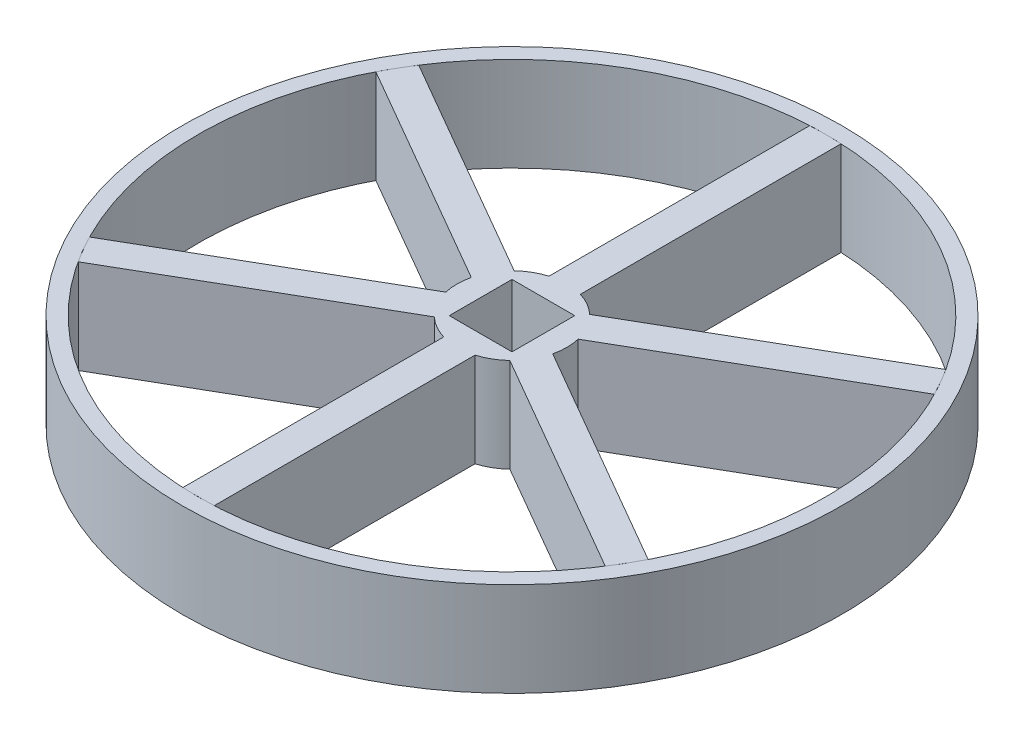
ISO-10303-21;
HEADER;
FILE_DESCRIPTION(('STEP AP214'),'2;1');
FILE_NAME('part.step','',(''),(''),'','','');
FILE_SCHEMA(('AUTOMOTIVE_DESIGN { 1 0 10303 214 1 1 1 1 }'));
ENDSEC;
DATA;
#1=APPLICATION_CONTEXT('core data for automotive mechanical design processes');
#2=APPLICATION_PROTOCOL_DEFINITION('international standard','automotive_design',2000,#1);
#3=PRODUCT_CONTEXT('',#1,'mechanical');
#4=PRODUCT('Part','Part','',(#3));
#5=PRODUCT_RELATED_PRODUCT_CATEGORY('part','',(#4));
#6=PRODUCT_DEFINITION_FORMATION('','',#4);
#7=PRODUCT_DEFINITION_CONTEXT('part definition',#1,'design');
#8=PRODUCT_DEFINITION('design','',#6,#7);
#9=PRODUCT_DEFINITION_SHAPE('','',#8);
#10=(LENGTH_UNIT() NAMED_UNIT(*) SI_UNIT(.MILLI.,.METRE.));
#11=(NAMED_UNIT(*) PLANE_ANGLE_UNIT() SI_UNIT($,.RADIAN.));
#12=(NAMED_UNIT(*) SI_UNIT($,.STERADIAN.) SOLID_ANGLE_UNIT());
#13=UNCERTAINTY_MEASURE_WITH_UNIT(LENGTH_MEASURE(1.E-05),#10,'distance_accuracy_value','');
#14=(GEOMETRIC_REPRESENTATION_CONTEXT(3) GLOBAL_UNCERTAINTY_ASSIGNED_CONTEXT((#13)) GLOBAL_UNIT_ASSIGNED_CONTEXT((#10,
#11,#12)) REPRESENTATION_CONTEXT('',''));
#15=CARTESIAN_POINT('',(0.,0.,0.));
#16=DIRECTION('',(0.,0.,1.));
#17=DIRECTION('',(1.,0.,0.));
#18=AXIS2_PLACEMENT_3D('',#15,#16,#17);
#19=CARTESIAN_POINT('',(0.,6.,0.));
#20=DIRECTION('',(0.,-1.,0.));
#21=DIRECTION('',(0.,0.,-1.));
#22=AXIS2_PLACEMENT_3D('',#19,#20,#21);
#23=CYLINDRICAL_SURFACE('',#22,3.5);
#24=CARTESIAN_POINT('',(0.,0.,0.));
#25=DIRECTION('',(0.,1.,0.));
#26=DIRECTION('',(0.,0.,1.));
#27=AXIS2_PLACEMENT_3D('',#24,#25,#26);
#28=CIRCLE('',#27,3.5);
#29=CARTESIAN_POINT('',(-2.40473750965557,0.,2.54307638690928));
#30=VERTEX_POINT('',#29);
#31=CARTESIAN_POINT('',(-1.,0.,3.35410196624968));
#32=VERTEX_POINT('',#31);
#33=EDGE_CURVE('E549',#30,#32,#28,.T.);
#34=ORIENTED_EDGE('',*,*,#33,.T.);
#35=DIRECTION('',(0.,-1.,0.));
#36=VECTOR('',#35,1.);
#37=CARTESIAN_POINT('',(-1.,6.,3.35410196624968));
#38=LINE('',#37,#36);
#39=CARTESIAN_POINT('',(-1.,6.,3.35410196624968));
#40=VERTEX_POINT('',#39);
#41=EDGE_CURVE('E556',#40,#32,#38,.T.);
#42=ORIENTED_EDGE('',*,*,#41,.F.);
#43=CARTESIAN_POINT('',(0.,6.,0.));
#44=DIRECTION('',(0.,1.,0.));
#45=DIRECTION('',(0.,0.,1.));
#46=AXIS2_PLACEMENT_3D('',#43,#44,#45);
#47=CIRCLE('',#46,3.5);
#48=CARTESIAN_POINT('',(-2.40473750965557,6.,2.54307638690928));
#49=VERTEX_POINT('',#48);
#50=EDGE_CURVE('E550',#49,#40,#47,.T.);
#51=ORIENTED_EDGE('',*,*,#50,.F.);
#52=DIRECTION('',(0.,-1.,0.));
#53=VECTOR('',#52,1.);
#54=CARTESIAN_POINT('',(-2.40473750965557,6.,2.54307638690928));
#55=LINE('',#54,#53);
#56=EDGE_CURVE('E558',#49,#30,#55,.T.);
#57=ORIENTED_EDGE('',*,*,#56,.T.);
#58=EDGE_LOOP('',(#34,#42,#51,#57));
#59=FACE_BOUND('',#58,.T.);
#60=ADVANCED_FACE('F331',(#59),#23,.T.);
#61=CARTESIAN_POINT('',(-0.999999999999976,0.,-3.35410196624969));
#62=VERTEX_POINT('',#61);
#63=CARTESIAN_POINT('',(-2.40473750965555,0.,-2.54307638690929));
#64=VERTEX_POINT('',#63);
#65=EDGE_CURVE('E830',#62,#64,#28,.T.);
#66=ORIENTED_EDGE('',*,*,#65,.T.);
#67=DIRECTION('',(0.,-1.,0.));
#68=VECTOR('',#67,1.);
#69=CARTESIAN_POINT('',(-2.40473750965555,6.,-2.54307638690929));
#70=LINE('',#69,#68);
#71=CARTESIAN_POINT('',(-2.40473750965555,6.,-2.54307638690929));
#72=VERTEX_POINT('',#71);
#73=EDGE_CURVE('E564',#72,#64,#70,.T.);
#74=ORIENTED_EDGE('',*,*,#73,.F.);
#75=CARTESIAN_POINT('',(-0.999999999999976,6.,-3.35410196624969));
#76=VERTEX_POINT('',#75);
#77=EDGE_CURVE('E853',#76,#72,#47,.T.);
#78=ORIENTED_EDGE('',*,*,#77,.F.);
#79=DIRECTION('',(0.,-1.,0.));
#80=VECTOR('',#79,1.);
#81=CARTESIAN_POINT('',(-0.999999999999976,6.,-3.35410196624969));
#82=LINE('',#81,#80);
#83=EDGE_CURVE('E566',#76,#62,#82,.T.);
#84=ORIENTED_EDGE('',*,*,#83,.T.);
#85=EDGE_LOOP('',(#66,#74,#78,#84));
#86=FACE_BOUND('',#85,.T.);
#87=ADVANCED_FACE('F789',(#86),#23,.T.);
#88=CARTESIAN_POINT('',(2.40473750965559,0.,-2.54307638690926));
#89=VERTEX_POINT('',#88);
#90=CARTESIAN_POINT('',(1.00000000000002,0.,-3.35410196624968));
#91=VERTEX_POINT('',#90);
#92=EDGE_CURVE('E834',#89,#91,#28,.T.);
#93=ORIENTED_EDGE('',*,*,#92,.T.);
#94=DIRECTION('',(0.,-1.,0.));
#95=VECTOR('',#94,1.);
#96=CARTESIAN_POINT('',(1.00000000000002,6.,-3.35410196624968));
#97=LINE('',#96,#95);
#98=CARTESIAN_POINT('',(1.00000000000002,6.,-3.35410196624968));
#99=VERTEX_POINT('',#98);
#100=EDGE_CURVE('E568',#99,#91,#97,.T.);
#101=ORIENTED_EDGE('',*,*,#100,.F.);
#102=CARTESIAN_POINT('',(2.40473750965559,6.,-2.54307638690926));
#103=VERTEX_POINT('',#102);
#104=EDGE_CURVE('E852',#103,#99,#47,.T.);
#105=ORIENTED_EDGE('',*,*,#104,.F.);
#106=DIRECTION('',(0.,-1.,0.));
#107=VECTOR('',#106,1.);
#108=CARTESIAN_POINT('',(2.40473750965559,6.,-2.54307638690926));
#109=LINE('',#108,#107);
#110=EDGE_CURVE('E570',#103,#89,#109,.T.);
#111=ORIENTED_EDGE('',*,*,#110,.T.);
#112=EDGE_LOOP('',(#93,#101,#105,#111));
#113=FACE_BOUND('',#112,.T.);
#114=ADVANCED_FACE('F802',(#113),#23,.T.);
#115=CARTESIAN_POINT('',(3.40473750965555,0.,0.811025579340444));
#116=VERTEX_POINT('',#115);
#117=CARTESIAN_POINT('',(3.40473750965557,0.,-0.811025579340372));
#118=VERTEX_POINT('',#117);
#119=EDGE_CURVE('E554',#116,#118,#28,.T.);
#120=ORIENTED_EDGE('',*,*,#119,.T.);
#121=DIRECTION('',(0.,-1.,0.));
#122=VECTOR('',#121,1.);
#123=CARTESIAN_POINT('',(3.40473750965557,6.,-0.811025579340372));
#124=LINE('',#123,#122);
#125=CARTESIAN_POINT('',(3.40473750965557,6.,-0.811025579340372));
#126=VERTEX_POINT('',#125);
#127=EDGE_CURVE('E572',#126,#118,#124,.T.);
#128=ORIENTED_EDGE('',*,*,#127,.F.);
#129=CARTESIAN_POINT('',(3.40473750965555,6.,0.811025579340444));
#130=VERTEX_POINT('',#129);
#131=EDGE_CURVE('E548',#130,#126,#47,.T.);
#132=ORIENTED_EDGE('',*,*,#131,.F.);
#133=DIRECTION('',(0.,-1.,0.));
#134=VECTOR('',#133,1.);
#135=CARTESIAN_POINT('',(3.40473750965555,6.,0.811025579340444));
#136=LINE('',#135,#134);
#137=EDGE_CURVE('E574',#130,#116,#136,.T.);
#138=ORIENTED_EDGE('',*,*,#137,.T.);
#139=EDGE_LOOP('',(#120,#128,#132,#138));
#140=FACE_BOUND('',#139,.T.);
#141=ADVANCED_FACE('F797',(#140),#23,.T.);
#142=CARTESIAN_POINT('',(1.,0.,3.35410196624968));
#143=VERTEX_POINT('',#142);
#144=CARTESIAN_POINT('',(2.40473750965553,0.,2.54307638690931));
#145=VERTEX_POINT('',#144);
#146=EDGE_CURVE('E551',#143,#145,#28,.T.);
#147=ORIENTED_EDGE('',*,*,#146,.T.);
#148=DIRECTION('',(0.,-1.,0.));
#149=VECTOR('',#148,1.);
#150=CARTESIAN_POINT('',(2.40473750965553,6.,2.54307638690931));
#151=LINE('',#150,#149);
#152=CARTESIAN_POINT('',(2.40473750965553,6.,2.54307638690931));
#153=VERTEX_POINT('',#152);
#154=EDGE_CURVE('E576',#153,#145,#151,.T.);
#155=ORIENTED_EDGE('',*,*,#154,.F.);
#156=CARTESIAN_POINT('',(1.,6.,3.35410196624968));
#157=VERTEX_POINT('',#156);
#158=EDGE_CURVE('E545',#157,#153,#47,.T.);
#159=ORIENTED_EDGE('',*,*,#158,.F.);
#160=DIRECTION('',(0.,-1.,0.));
#161=VECTOR('',#160,1.);
#162=CARTESIAN_POINT('',(1.,6.,3.35410196624968));
#163=LINE('',#162,#161);
#164=EDGE_CURVE('E578',#157,#143,#163,.T.);
#165=ORIENTED_EDGE('',*,*,#164,.T.);
#166=EDGE_LOOP('',(#147,#155,#159,#165));
#167=FACE_BOUND('',#166,.T.);
#168=ADVANCED_FACE('F791',(#167),#23,.T.);
#169=CARTESIAN_POINT('',(0.,6.,0.));
#170=DIRECTION('',(0.,1.,0.));
#171=DIRECTION('',(0.,0.,1.));
#172=AXIS2_PLACEMENT_3D('',#169,#170,#171);
#173=PLANE('',#172);
#174=DIRECTION('',(0.,0.,1.));
#175=VECTOR('',#174,1.);
#176=CARTESIAN_POINT('',(-2.,6.,-2.));
#177=LINE('',#176,#175);
#178=CARTESIAN_POINT('',(-2.,6.,-2.));
#179=VERTEX_POINT('',#178);
#180=CARTESIAN_POINT('',(-2.,6.,2.));
#181=VERTEX_POINT('',#180);
#182=EDGE_CURVE('E346',#179,#181,#177,.T.);
#183=ORIENTED_EDGE('',*,*,#182,.F.);
#184=DIRECTION('',(-1.,0.,0.));
#185=VECTOR('',#184,1.);
#186=CARTESIAN_POINT('',(-2.,6.,-2.));
#187=LINE('',#186,#185);
#188=CARTESIAN_POINT('',(2.,6.,-2.));
#189=VERTEX_POINT('',#188);
#190=EDGE_CURVE('E535',#189,#179,#187,.T.);
#191=ORIENTED_EDGE('',*,*,#190,.F.);
#192=DIRECTION('',(0.,0.,-1.));
#193=VECTOR('',#192,1.);
#194=CARTESIAN_POINT('',(2.,6.,-2.));
#195=LINE('',#194,#193);
#196=CARTESIAN_POINT('',(2.,6.,2.));
#197=VERTEX_POINT('',#196);
#198=EDGE_CURVE('E519',#197,#189,#195,.T.);
#199=ORIENTED_EDGE('',*,*,#198,.F.);
#200=DIRECTION('',(1.,0.,0.));
#201=VECTOR('',#200,1.);
#202=CARTESIAN_POINT('',(-2.,6.,2.));
#203=LINE('',#202,#201);
#204=EDGE_CURVE('E528',#181,#197,#203,.T.);
#205=ORIENTED_EDGE('',*,*,#204,.F.);
#206=EDGE_LOOP('',(#183,#191,#199,#205));
#207=FACE_BOUND('',#206,.T.);
#208=ORIENTED_EDGE('',*,*,#50,.T.);
#209=DIRECTION('',(0.,0.,1.));
#210=VECTOR('',#209,1.);
#211=CARTESIAN_POINT('',(-1.,6.,3.35410196624968));
#212=LINE('',#211,#210);
#213=CARTESIAN_POINT('',(-0.999999999999998,6.,19.9683336882158));
#214=VERTEX_POINT('',#213);
#215=EDGE_CURVE('E587',#40,#214,#212,.T.);
#216=ORIENTED_EDGE('',*,*,#215,.T.);
#217=CARTESIAN_POINT('',(0.,6.,0.));
#218=DIRECTION('',(0.,1.,0.));
#219=DIRECTION('',(0.,0.,1.));
#220=AXIS2_PLACEMENT_3D('',#217,#218,#219);
#221=CIRCLE('',#220,19.9933576540793);
#222=CARTESIAN_POINT('',(0.999999999999994,6.,19.9683336882158));
#223=VERTEX_POINT('',#222);
#224=EDGE_CURVE('E584',#214,#223,#221,.T.);
#225=ORIENTED_EDGE('',*,*,#224,.T.);
#226=DIRECTION('',(0.,0.,1.));
#227=VECTOR('',#226,1.);
#228=CARTESIAN_POINT('',(1.,6.,3.35410196624968));
#229=LINE('',#228,#227);
#230=EDGE_CURVE('E581',#157,#223,#229,.T.);
#231=ORIENTED_EDGE('',*,*,#230,.F.);
#232=ORIENTED_EDGE('',*,*,#158,.T.);
#233=DIRECTION('',(0.866025403784433,0.,0.50000000000001));
#234=VECTOR('',#233,1.);
#235=CARTESIAN_POINT('',(2.40473750965553,6.,2.54307638690931));
#236=LINE('',#235,#234);
#237=CARTESIAN_POINT('',(16.7930842452393,6.,10.8501922478925));
#238=VERTEX_POINT('',#237);
#239=EDGE_CURVE('E607',#153,#238,#236,.T.);
#240=ORIENTED_EDGE('',*,*,#239,.T.);
#241=CARTESIAN_POINT('',(0.,6.,0.));
#242=DIRECTION('',(0.,1.,0.));
#243=DIRECTION('',(0.,0.,1.));
#244=AXIS2_PLACEMENT_3D('',#241,#242,#243);
#245=CIRCLE('',#244,19.9933576540793);
#246=CARTESIAN_POINT('',(17.7930842452393,6.,9.11814144032364));
#247=VERTEX_POINT('',#246);
#248=EDGE_CURVE('E604',#238,#247,#245,.T.);
#249=ORIENTED_EDGE('',*,*,#248,.T.);
#250=DIRECTION('',(0.866025403784433,0.,0.50000000000001));
#251=VECTOR('',#250,1.);
#252=CARTESIAN_POINT('',(3.40473750965555,6.,0.811025579340444));
#253=LINE('',#252,#251);
#254=EDGE_CURVE('E601',#130,#247,#253,.T.);
#255=ORIENTED_EDGE('',*,*,#254,.F.);
#256=ORIENTED_EDGE('',*,*,#131,.T.);
#257=DIRECTION('',(0.866025403784443,0.,-0.499999999999992));
#258=VECTOR('',#257,1.);
#259=CARTESIAN_POINT('',(3.40473750965557,6.,-0.811025579340372));
#260=LINE('',#259,#258);
#261=CARTESIAN_POINT('',(17.7930842452395,6.,-9.11814144032327));
#262=VERTEX_POINT('',#261);
#263=EDGE_CURVE('E627',#126,#262,#260,.T.);
#264=ORIENTED_EDGE('',*,*,#263,.T.);
#265=CARTESIAN_POINT('',(0.,6.,0.));
#266=DIRECTION('',(0.,1.,0.));
#267=DIRECTION('',(0.,0.,1.));
#268=AXIS2_PLACEMENT_3D('',#265,#266,#267);
#269=CIRCLE('',#268,19.9933576540793);
#270=CARTESIAN_POINT('',(16.7930842452396,6.,-10.8501922478922));
#271=VERTEX_POINT('',#270);
#272=EDGE_CURVE('E624',#262,#271,#269,.T.);
#273=ORIENTED_EDGE('',*,*,#272,.T.);
#274=DIRECTION('',(0.866025403784443,0.,-0.499999999999992));
#275=VECTOR('',#274,1.);
#276=CARTESIAN_POINT('',(2.40473750965559,6.,-2.54307638690926));
#277=LINE('',#276,#275);
#278=EDGE_CURVE('E621',#103,#271,#277,.T.);
#279=ORIENTED_EDGE('',*,*,#278,.F.);
#280=ORIENTED_EDGE('',*,*,#104,.T.);
#281=DIRECTION('',(0.,0.,-1.));
#282=VECTOR('',#281,1.);
#283=CARTESIAN_POINT('',(1.00000000000002,6.,-3.35410196624968));
#284=LINE('',#283,#282);
#285=CARTESIAN_POINT('',(1.00000000000014,6.,-19.9683336882157));
#286=VERTEX_POINT('',#285);
#287=EDGE_CURVE('E647',#99,#286,#284,.T.);
#288=ORIENTED_EDGE('',*,*,#287,.T.);
#289=CARTESIAN_POINT('',(0.,6.,0.));
#290=DIRECTION('',(0.,1.,0.));
#291=DIRECTION('',(0.,0.,1.));
#292=AXIS2_PLACEMENT_3D('',#289,#290,#291);
#293=CIRCLE('',#292,19.9933576540793);
#294=CARTESIAN_POINT('',(-0.999999999999863,6.,-19.9683336882158));
#295=VERTEX_POINT('',#294);
#296=EDGE_CURVE('E644',#286,#295,#293,.T.);
#297=ORIENTED_EDGE('',*,*,#296,.T.);
#298=DIRECTION('',(0.,0.,-1.));
#299=VECTOR('',#298,1.);
#300=CARTESIAN_POINT('',(-0.999999999999976,6.,-3.35410196624969));
#301=LINE('',#300,#299);
#302=EDGE_CURVE('E641',#76,#295,#301,.T.);
#303=ORIENTED_EDGE('',*,*,#302,.F.);
#304=ORIENTED_EDGE('',*,*,#77,.T.);
#305=DIRECTION('',(-0.866025403784436,0.,-0.500000000000004));
#306=VECTOR('',#305,1.);
#307=CARTESIAN_POINT('',(-2.40473750965555,6.,-2.54307638690929));
#308=LINE('',#307,#306);
#309=CARTESIAN_POINT('',(-16.7930842452394,6.,-10.8501922478924));
#310=VERTEX_POINT('',#309);
#311=EDGE_CURVE('E667',#72,#310,#308,.T.);
#312=ORIENTED_EDGE('',*,*,#311,.T.);
#313=CARTESIAN_POINT('',(0.,6.,0.));
#314=DIRECTION('',(0.,1.,0.));
#315=DIRECTION('',(0.,0.,1.));
#316=AXIS2_PLACEMENT_3D('',#313,#314,#315);
#317=CIRCLE('',#316,19.9933576540793);
#318=CARTESIAN_POINT('',(-17.7930842452394,6.,-9.11814144032352));
#319=VERTEX_POINT('',#318);
#320=EDGE_CURVE('E664',#310,#319,#317,.T.);
#321=ORIENTED_EDGE('',*,*,#320,.T.);
#322=DIRECTION('',(-0.866025403784436,0.,-0.500000000000004));
#323=VECTOR('',#322,1.);
#324=CARTESIAN_POINT('',(-3.40473750965556,6.,-0.811025579340421));
#325=LINE('',#324,#323);
#326=CARTESIAN_POINT('',(-3.40473750965556,6.,-0.81102557934042));
#327=VERTEX_POINT('',#326);
#328=EDGE_CURVE('E661',#327,#319,#325,.T.);
#329=ORIENTED_EDGE('',*,*,#328,.F.);
#330=CARTESIAN_POINT('',(-3.40473750965557,6.,0.811025579340396));
#331=VERTEX_POINT('',#330);
#332=EDGE_CURVE('E855',#327,#331,#47,.T.);
#333=ORIENTED_EDGE('',*,*,#332,.T.);
#334=DIRECTION('',(-0.86602540378444,0.,0.499999999999998));
#335=VECTOR('',#334,1.);
#336=CARTESIAN_POINT('',(-3.40473750965557,6.,0.811025579340396));
#337=LINE('',#336,#335);
#338=CARTESIAN_POINT('',(-17.7930842452395,6.,9.1181414403234));
#339=VERTEX_POINT('',#338);
#340=EDGE_CURVE('E687',#331,#339,#337,.T.);
#341=ORIENTED_EDGE('',*,*,#340,.T.);
#342=CARTESIAN_POINT('',(0.,6.,0.));
#343=DIRECTION('',(0.,1.,0.));
#344=DIRECTION('',(0.,0.,1.));
#345=AXIS2_PLACEMENT_3D('',#342,#343,#344);
#346=CIRCLE('',#345,19.9933576540793);
#347=CARTESIAN_POINT('',(-16.7930842452395,6.,10.8501922478923));
#348=VERTEX_POINT('',#347);
#349=EDGE_CURVE('E684',#339,#348,#346,.T.);
#350=ORIENTED_EDGE('',*,*,#349,.T.);
#351=DIRECTION('',(-0.86602540378444,0.,0.499999999999998));
#352=VECTOR('',#351,1.);
#353=CARTESIAN_POINT('',(-2.40473750965557,6.,2.54307638690928));
#354=LINE('',#353,#352);
#355=EDGE_CURVE('E681',#49,#348,#354,.T.);
#356=ORIENTED_EDGE('',*,*,#355,.F.);
#357=EDGE_LOOP('',(#208,#216,#225,#231,#232,#240,#249,#255,#256,#264,#273,#279,#280,#288,#297,
#303,#304,#312,#321,#329,#333,#341,#350,#356));
#358=FACE_BOUND('',#357,.T.);
#359=ADVANCED_FACE('F532',(#207,#358),#173,.T.);
#360=CARTESIAN_POINT('',(0.,0.,0.));
#361=DIRECTION('',(0.,1.,0.));
#362=DIRECTION('',(0.,0.,1.));
#363=AXIS2_PLACEMENT_3D('',#360,#361,#362);
#364=PLANE('',#363);
#365=DIRECTION('',(-1.,0.,0.));
#366=VECTOR('',#365,1.);
#367=CARTESIAN_POINT('',(0.,0.,-2.));
#368=LINE('',#367,#366);
#369=CARTESIAN_POINT('',(2.,0.,-2.));
#370=VERTEX_POINT('',#369);
#371=CARTESIAN_POINT('',(-2.,0.,-2.));
#372=VERTEX_POINT('',#371);
#373=EDGE_CURVE('E339',#370,#372,#368,.T.);
#374=ORIENTED_EDGE('',*,*,#373,.T.);
#375=DIRECTION('',(0.,0.,1.));
#376=VECTOR('',#375,1.);
#377=CARTESIAN_POINT('',(-2.,0.,0.));
#378=LINE('',#377,#376);
#379=CARTESIAN_POINT('',(-2.,0.,2.));
#380=VERTEX_POINT('',#379);
#381=EDGE_CURVE('E13',#372,#380,#378,.T.);
#382=ORIENTED_EDGE('',*,*,#381,.T.);
#383=DIRECTION('',(1.,0.,0.));
#384=VECTOR('',#383,1.);
#385=CARTESIAN_POINT('',(0.,0.,2.));
#386=LINE('',#385,#384);
#387=CARTESIAN_POINT('',(2.,0.,2.));
#388=VERTEX_POINT('',#387);
#389=EDGE_CURVE('E580',#380,#388,#386,.T.);
#390=ORIENTED_EDGE('',*,*,#389,.T.);
#391=DIRECTION('',(0.,0.,-1.));
#392=VECTOR('',#391,1.);
#393=CARTESIAN_POINT('',(2.,0.,0.));
#394=LINE('',#393,#392);
#395=EDGE_CURVE('E522',#388,#370,#394,.T.);
#396=ORIENTED_EDGE('',*,*,#395,.T.);
#397=EDGE_LOOP('',(#374,#382,#390,#396));
#398=FACE_BOUND('',#397,.T.);
#399=ORIENTED_EDGE('',*,*,#146,.F.);
#400=DIRECTION('',(0.,0.,1.));
#401=VECTOR('',#400,1.);
#402=CARTESIAN_POINT('',(1.,0.,3.35410196624968));
#403=LINE('',#402,#401);
#404=CARTESIAN_POINT('',(0.999999999999994,0.,19.9683336882158));
#405=VERTEX_POINT('',#404);
#406=EDGE_CURVE('E590',#143,#405,#403,.T.);
#407=ORIENTED_EDGE('',*,*,#406,.T.);
#408=CARTESIAN_POINT('',(0.,0.,0.));
#409=DIRECTION('',(0.,1.,0.));
#410=DIRECTION('',(0.,0.,1.));
#411=AXIS2_PLACEMENT_3D('',#408,#409,#410);
#412=CIRCLE('',#411,19.9933576540793);
#413=CARTESIAN_POINT('',(-0.999999999999998,0.,19.9683336882158));
#414=VERTEX_POINT('',#413);
#415=EDGE_CURVE('E593',#414,#405,#412,.T.);
#416=ORIENTED_EDGE('',*,*,#415,.F.);
#417=DIRECTION('',(0.,0.,1.));
#418=VECTOR('',#417,1.);
#419=CARTESIAN_POINT('',(-1.,0.,3.35410196624968));
#420=LINE('',#419,#418);
#421=EDGE_CURVE('E585',#32,#414,#420,.T.);
#422=ORIENTED_EDGE('',*,*,#421,.F.);
#423=ORIENTED_EDGE('',*,*,#33,.F.);
#424=DIRECTION('',(-0.86602540378444,0.,0.499999999999998));
#425=VECTOR('',#424,1.);
#426=CARTESIAN_POINT('',(-2.40473750965557,0.,2.54307638690928));
#427=LINE('',#426,#425);
#428=CARTESIAN_POINT('',(-16.7930842452395,0.,10.8501922478923));
#429=VERTEX_POINT('',#428);
#430=EDGE_CURVE('E542',#30,#429,#427,.T.);
#431=ORIENTED_EDGE('',*,*,#430,.T.);
#432=CARTESIAN_POINT('',(0.,0.,0.));
#433=DIRECTION('',(0.,1.,0.));
#434=DIRECTION('',(0.,0.,1.));
#435=AXIS2_PLACEMENT_3D('',#432,#433,#434);
#436=CIRCLE('',#435,19.9933576540793);
#437=CARTESIAN_POINT('',(-17.7930842452395,0.,9.1181414403234));
#438=VERTEX_POINT('',#437);
#439=EDGE_CURVE('E692',#438,#429,#436,.T.);
#440=ORIENTED_EDGE('',*,*,#439,.F.);
#441=DIRECTION('',(-0.86602540378444,0.,0.499999999999998));
#442=VECTOR('',#441,1.);
#443=CARTESIAN_POINT('',(-3.40473750965557,0.,0.811025579340396));
#444=LINE('',#443,#442);
#445=CARTESIAN_POINT('',(-3.40473750965557,0.,0.811025579340396));
#446=VERTEX_POINT('',#445);
#447=EDGE_CURVE('E685',#446,#438,#444,.T.);
#448=ORIENTED_EDGE('',*,*,#447,.F.);
#449=CARTESIAN_POINT('',(-3.40473750965556,0.,-0.81102557934042));
#450=VERTEX_POINT('',#449);
#451=EDGE_CURVE('E828',#450,#446,#28,.T.);
#452=ORIENTED_EDGE('',*,*,#451,.F.);
#453=DIRECTION('',(-0.866025403784436,0.,-0.500000000000004));
#454=VECTOR('',#453,1.);
#455=CARTESIAN_POINT('',(-3.40473750965556,0.,-0.811025579340421));
#456=LINE('',#455,#454);
#457=CARTESIAN_POINT('',(-17.7930842452394,0.,-9.11814144032352));
#458=VERTEX_POINT('',#457);
#459=EDGE_CURVE('E670',#450,#458,#456,.T.);
#460=ORIENTED_EDGE('',*,*,#459,.T.);
#461=CARTESIAN_POINT('',(0.,0.,0.));
#462=DIRECTION('',(0.,1.,0.));
#463=DIRECTION('',(0.,0.,1.));
#464=AXIS2_PLACEMENT_3D('',#461,#462,#463);
#465=CIRCLE('',#464,19.9933576540793);
#466=CARTESIAN_POINT('',(-16.7930842452394,0.,-10.8501922478924));
#467=VERTEX_POINT('',#466);
#468=EDGE_CURVE('E673',#467,#458,#465,.T.);
#469=ORIENTED_EDGE('',*,*,#468,.F.);
#470=DIRECTION('',(-0.866025403784436,0.,-0.500000000000004));
#471=VECTOR('',#470,1.);
#472=CARTESIAN_POINT('',(-2.40473750965555,0.,-2.54307638690929));
#473=LINE('',#472,#471);
#474=EDGE_CURVE('E665',#64,#467,#473,.T.);
#475=ORIENTED_EDGE('',*,*,#474,.F.);
#476=ORIENTED_EDGE('',*,*,#65,.F.);
#477=DIRECTION('',(0.,0.,-1.));
#478=VECTOR('',#477,1.);
#479=CARTESIAN_POINT('',(-0.999999999999976,0.,-3.35410196624969));
#480=LINE('',#479,#478);
#481=CARTESIAN_POINT('',(-0.999999999999863,0.,-19.9683336882158));
#482=VERTEX_POINT('',#481);
#483=EDGE_CURVE('E650',#62,#482,#480,.T.);
#484=ORIENTED_EDGE('',*,*,#483,.T.);
#485=CARTESIAN_POINT('',(0.,0.,0.));
#486=DIRECTION('',(0.,1.,0.));
#487=DIRECTION('',(0.,0.,1.));
#488=AXIS2_PLACEMENT_3D('',#485,#486,#487);
#489=CIRCLE('',#488,19.9933576540793);
#490=CARTESIAN_POINT('',(1.00000000000014,0.,-19.9683336882157));
#491=VERTEX_POINT('',#490);
#492=EDGE_CURVE('E653',#491,#482,#489,.T.);
#493=ORIENTED_EDGE('',*,*,#492,.F.);
#494=DIRECTION('',(0.,0.,-1.));
#495=VECTOR('',#494,1.);
#496=CARTESIAN_POINT('',(1.00000000000002,0.,-3.35410196624968));
#497=LINE('',#496,#495);
#498=EDGE_CURVE('E645',#91,#491,#497,.T.);
#499=ORIENTED_EDGE('',*,*,#498,.F.);
#500=ORIENTED_EDGE('',*,*,#92,.F.);
#501=DIRECTION('',(0.866025403784443,0.,-0.499999999999992));
#502=VECTOR('',#501,1.);
#503=CARTESIAN_POINT('',(2.40473750965559,0.,-2.54307638690926));
#504=LINE('',#503,#502);
#505=CARTESIAN_POINT('',(16.7930842452396,0.,-10.8501922478922));
#506=VERTEX_POINT('',#505);
#507=EDGE_CURVE('E630',#89,#506,#504,.T.);
#508=ORIENTED_EDGE('',*,*,#507,.T.);
#509=CARTESIAN_POINT('',(0.,0.,0.));
#510=DIRECTION('',(0.,1.,0.));
#511=DIRECTION('',(0.,0.,1.));
#512=AXIS2_PLACEMENT_3D('',#509,#510,#511);
#513=CIRCLE('',#512,19.9933576540793);
#514=CARTESIAN_POINT('',(17.7930842452395,0.,-9.11814144032327));
#515=VERTEX_POINT('',#514);
#516=EDGE_CURVE('E633',#515,#506,#513,.T.);
#517=ORIENTED_EDGE('',*,*,#516,.F.);
#518=DIRECTION('',(0.866025403784443,0.,-0.499999999999992));
#519=VECTOR('',#518,1.);
#520=CARTESIAN_POINT('',(3.40473750965557,0.,-0.811025579340372));
#521=LINE('',#520,#519);
#522=EDGE_CURVE('E625',#118,#515,#521,.T.);
#523=ORIENTED_EDGE('',*,*,#522,.F.);
#524=ORIENTED_EDGE('',*,*,#119,.F.);
#525=DIRECTION('',(0.866025403784433,0.,0.50000000000001));
#526=VECTOR('',#525,1.);
#527=CARTESIAN_POINT('',(3.40473750965555,0.,0.811025579340444));
#528=LINE('',#527,#526);
#529=CARTESIAN_POINT('',(17.7930842452393,0.,9.11814144032364));
#530=VERTEX_POINT('',#529);
#531=EDGE_CURVE('E610',#116,#530,#528,.T.);
#532=ORIENTED_EDGE('',*,*,#531,.T.);
#533=CARTESIAN_POINT('',(0.,0.,0.));
#534=DIRECTION('',(0.,1.,0.));
#535=DIRECTION('',(0.,0.,1.));
#536=AXIS2_PLACEMENT_3D('',#533,#534,#535);
#537=CIRCLE('',#536,19.9933576540793);
#538=CARTESIAN_POINT('',(16.7930842452393,0.,10.8501922478925));
#539=VERTEX_POINT('',#538);
#540=EDGE_CURVE('E613',#539,#530,#537,.T.);
#541=ORIENTED_EDGE('',*,*,#540,.F.);
#542=DIRECTION('',(0.866025403784433,0.,0.50000000000001));
#543=VECTOR('',#542,1.);
#544=CARTESIAN_POINT('',(2.40473750965553,0.,2.54307638690931));
#545=LINE('',#544,#543);
#546=EDGE_CURVE('E605',#145,#539,#545,.T.);
#547=ORIENTED_EDGE('',*,*,#546,.F.);
#548=EDGE_LOOP('',(#399,#407,#416,#422,#423,#431,#440,#448,#452,#460,#469,#475,#476,#484,#493,
#499,#500,#508,#517,#523,#524,#532,#541,#547));
#549=FACE_BOUND('',#548,.T.);
#550=ADVANCED_FACE('F702',(#398,#549),#364,.F.);
#551=ORIENTED_EDGE('',*,*,#451,.T.);
#552=DIRECTION('',(0.,-1.,0.));
#553=VECTOR('',#552,1.);
#554=CARTESIAN_POINT('',(-3.40473750965557,6.,0.811025579340396));
#555=LINE('',#554,#553);
#556=EDGE_CURVE('E560',#331,#446,#555,.T.);
#557=ORIENTED_EDGE('',*,*,#556,.F.);
#558=ORIENTED_EDGE('',*,*,#332,.F.);
#559=DIRECTION('',(0.,-1.,0.));
#560=VECTOR('',#559,1.);
#561=CARTESIAN_POINT('',(-3.40473750965556,6.,-0.81102557934042));
#562=LINE('',#561,#560);
#563=EDGE_CURVE('E562',#327,#450,#562,.T.);
#564=ORIENTED_EDGE('',*,*,#563,.T.);
#565=EDGE_LOOP('',(#551,#557,#558,#564));
#566=FACE_BOUND('',#565,.T.);
#567=ADVANCED_FACE('F751',(#566),#23,.T.);
#568=CARTESIAN_POINT('',(-2.40473750965557,6.,2.54307638690928));
#569=DIRECTION('',(0.499999999999998,0.,0.86602540378444));
#570=DIRECTION('',(0.86602540378444,0.,-0.499999999999998));
#571=AXIS2_PLACEMENT_3D('',#568,#569,#570);
#572=PLANE('',#571);
#573=ORIENTED_EDGE('',*,*,#430,.F.);
#574=ORIENTED_EDGE('',*,*,#56,.F.);
#575=ORIENTED_EDGE('',*,*,#355,.T.);
#576=DIRECTION('',(0.,-1.,0.));
#577=VECTOR('',#576,1.);
#578=CARTESIAN_POINT('',(-16.7930842452395,6.,10.8501922478923));
#579=LINE('',#578,#577);
#580=EDGE_CURVE('E689',#348,#429,#579,.T.);
#581=ORIENTED_EDGE('',*,*,#580,.T.);
#582=EDGE_LOOP('',(#573,#574,#575,#581));
#583=FACE_BOUND('',#582,.T.);
#584=ADVANCED_FACE('F333',(#583),#572,.T.);
#585=CARTESIAN_POINT('',(0.,6.,0.));
#586=DIRECTION('',(0.,-1.,0.));
#587=DIRECTION('',(0.,0.,-1.));
#588=AXIS2_PLACEMENT_3D('',#585,#586,#587);
#589=CYLINDRICAL_SURFACE('',#588,19.9933576540793);
#590=ORIENTED_EDGE('',*,*,#439,.T.);
#591=ORIENTED_EDGE('',*,*,#580,.F.);
#592=ORIENTED_EDGE('',*,*,#349,.F.);
#593=DIRECTION('',(0.,-1.,0.));
#594=VECTOR('',#593,1.);
#595=CARTESIAN_POINT('',(-17.7930842452395,6.,9.1181414403234));
#596=LINE('',#595,#594);
#597=EDGE_CURVE('E674',#339,#438,#596,.T.);
#598=ORIENTED_EDGE('',*,*,#597,.T.);
#599=EDGE_LOOP('',(#590,#591,#592,#598));
#600=FACE_BOUND('',#599,.T.);
#601=ADVANCED_FACE('F730',(#600),#589,.T.);
#602=CARTESIAN_POINT('',(-3.40473750965557,6.,0.811025579340396));
#603=DIRECTION('',(0.499999999999998,0.,0.86602540378444));
#604=DIRECTION('',(0.86602540378444,0.,-0.499999999999998));
#605=AXIS2_PLACEMENT_3D('',#602,#603,#604);
#606=PLANE('',#605);
#607=ORIENTED_EDGE('',*,*,#447,.T.);
#608=ORIENTED_EDGE('',*,*,#597,.F.);
#609=ORIENTED_EDGE('',*,*,#340,.F.);
#610=ORIENTED_EDGE('',*,*,#556,.T.);
#611=EDGE_LOOP('',(#607,#608,#609,#610));
#612=FACE_BOUND('',#611,.T.);
#613=ADVANCED_FACE('F727',(#612),#606,.F.);
#614=CARTESIAN_POINT('',(-3.40473750965556,6.,-0.811025579340421));
#615=DIRECTION('',(-0.500000000000004,0.,0.866025403784436));
#616=DIRECTION('',(0.866025403784437,0.,0.500000000000004));
#617=AXIS2_PLACEMENT_3D('',#614,#615,#616);
#618=PLANE('',#617);
#619=ORIENTED_EDGE('',*,*,#459,.F.);
#620=ORIENTED_EDGE('',*,*,#563,.F.);
#621=ORIENTED_EDGE('',*,*,#328,.T.);
#622=DIRECTION('',(0.,-1.,0.));
#623=VECTOR('',#622,1.);
#624=CARTESIAN_POINT('',(-17.7930842452394,6.,-9.11814144032352));
#625=LINE('',#624,#623);
#626=EDGE_CURVE('E669',#319,#458,#625,.T.);
#627=ORIENTED_EDGE('',*,*,#626,.T.);
#628=EDGE_LOOP('',(#619,#620,#621,#627));
#629=FACE_BOUND('',#628,.T.);
#630=ADVANCED_FACE('F729',(#629),#618,.T.);
#631=CARTESIAN_POINT('',(0.,6.,0.));
#632=DIRECTION('',(0.,-1.,0.));
#633=DIRECTION('',(0.,0.,-1.));
#634=AXIS2_PLACEMENT_3D('',#631,#632,#633);
#635=CYLINDRICAL_SURFACE('',#634,19.9933576540793);
#636=ORIENTED_EDGE('',*,*,#468,.T.);
#637=ORIENTED_EDGE('',*,*,#626,.F.);
#638=ORIENTED_EDGE('',*,*,#320,.F.);
#639=DIRECTION('',(0.,-1.,0.));
#640=VECTOR('',#639,1.);
#641=CARTESIAN_POINT('',(-16.7930842452394,6.,-10.8501922478924));
#642=LINE('',#641,#640);
#643=EDGE_CURVE('E654',#310,#467,#642,.T.);
#644=ORIENTED_EDGE('',*,*,#643,.T.);
#645=EDGE_LOOP('',(#636,#637,#638,#644));
#646=FACE_BOUND('',#645,.T.);
#647=ADVANCED_FACE('F737',(#646),#635,.T.);
#648=CARTESIAN_POINT('',(-2.40473750965555,6.,-2.54307638690929));
#649=DIRECTION('',(-0.500000000000004,0.,0.866025403784436));
#650=DIRECTION('',(0.866025403784436,0.,0.500000000000004));
#651=AXIS2_PLACEMENT_3D('',#648,#649,#650);
#652=PLANE('',#651);
#653=ORIENTED_EDGE('',*,*,#474,.T.);
#654=ORIENTED_EDGE('',*,*,#643,.F.);
#655=ORIENTED_EDGE('',*,*,#311,.F.);
#656=ORIENTED_EDGE('',*,*,#73,.T.);
#657=EDGE_LOOP('',(#653,#654,#655,#656));
#658=FACE_BOUND('',#657,.T.);
#659=ADVANCED_FACE('F745',(#658),#652,.F.);
#660=CARTESIAN_POINT('',(-0.999999999999976,6.,-3.35410196624969));
#661=DIRECTION('',(-1.,0.,0.));
#662=DIRECTION('',(0.,0.,1.));
#663=AXIS2_PLACEMENT_3D('',#660,#661,#662);
#664=PLANE('',#663);
#665=ORIENTED_EDGE('',*,*,#483,.F.);
#666=ORIENTED_EDGE('',*,*,#83,.F.);
#667=ORIENTED_EDGE('',*,*,#302,.T.);
#668=DIRECTION('',(0.,-1.,0.));
#669=VECTOR('',#668,1.);
#670=CARTESIAN_POINT('',(-0.999999999999863,6.,-19.9683336882158));
#671=LINE('',#670,#669);
#672=EDGE_CURVE('E649',#295,#482,#671,.T.);
#673=ORIENTED_EDGE('',*,*,#672,.T.);
#674=EDGE_LOOP('',(#665,#666,#667,#673));
#675=FACE_BOUND('',#674,.T.);
#676=ADVANCED_FACE('F749',(#675),#664,.T.);
#677=CARTESIAN_POINT('',(0.,6.,0.));
#678=DIRECTION('',(0.,-1.,0.));
#679=DIRECTION('',(0.,0.,-1.));
#680=AXIS2_PLACEMENT_3D('',#677,#678,#679);
#681=CYLINDRICAL_SURFACE('',#680,19.9933576540793);
#682=ORIENTED_EDGE('',*,*,#492,.T.);
#683=ORIENTED_EDGE('',*,*,#672,.F.);
#684=ORIENTED_EDGE('',*,*,#296,.F.);
#685=DIRECTION('',(0.,-1.,0.));
#686=VECTOR('',#685,1.);
#687=CARTESIAN_POINT('',(1.00000000000014,6.,-19.9683336882157));
#688=LINE('',#687,#686);
#689=EDGE_CURVE('E634',#286,#491,#688,.T.);
#690=ORIENTED_EDGE('',*,*,#689,.T.);
#691=EDGE_LOOP('',(#682,#683,#684,#690));
#692=FACE_BOUND('',#691,.T.);
#693=ADVANCED_FACE('F754',(#692),#681,.T.);
#694=CARTESIAN_POINT('',(1.00000000000002,6.,-3.35410196624968));
#695=DIRECTION('',(-1.,0.,0.));
#696=DIRECTION('',(0.,0.,1.));
#697=AXIS2_PLACEMENT_3D('',#694,#695,#696);
#698=PLANE('',#697);
#699=ORIENTED_EDGE('',*,*,#498,.T.);
#700=ORIENTED_EDGE('',*,*,#689,.F.);
#701=ORIENTED_EDGE('',*,*,#287,.F.);
#702=ORIENTED_EDGE('',*,*,#100,.T.);
#703=EDGE_LOOP('',(#699,#700,#701,#702));
#704=FACE_BOUND('',#703,.T.);
#705=ADVANCED_FACE('F740',(#704),#698,.F.);
#706=CARTESIAN_POINT('',(2.40473750965559,6.,-2.54307638690926));
#707=DIRECTION('',(-0.499999999999992,0.,-0.866025403784443));
#708=DIRECTION('',(-0.866025403784443,0.,0.499999999999992));
#709=AXIS2_PLACEMENT_3D('',#706,#707,#708);
#710=PLANE('',#709);
#711=ORIENTED_EDGE('',*,*,#507,.F.);
#712=ORIENTED_EDGE('',*,*,#110,.F.);
#713=ORIENTED_EDGE('',*,*,#278,.T.);
#714=DIRECTION('',(0.,-1.,0.));
#715=VECTOR('',#714,1.);
#716=CARTESIAN_POINT('',(16.7930842452396,6.,-10.8501922478922));
#717=LINE('',#716,#715);
#718=EDGE_CURVE('E629',#271,#506,#717,.T.);
#719=ORIENTED_EDGE('',*,*,#718,.T.);
#720=EDGE_LOOP('',(#711,#712,#713,#719));
#721=FACE_BOUND('',#720,.T.);
#722=ADVANCED_FACE('F762',(#721),#710,.T.);
#723=CARTESIAN_POINT('',(0.,6.,0.));
#724=DIRECTION('',(0.,-1.,0.));
#725=DIRECTION('',(0.,0.,-1.));
#726=AXIS2_PLACEMENT_3D('',#723,#724,#725);
#727=CYLINDRICAL_SURFACE('',#726,19.9933576540793);
#728=ORIENTED_EDGE('',*,*,#516,.T.);
#729=ORIENTED_EDGE('',*,*,#718,.F.);
#730=ORIENTED_EDGE('',*,*,#272,.F.);
#731=DIRECTION('',(0.,-1.,0.));
#732=VECTOR('',#731,1.);
#733=CARTESIAN_POINT('',(17.7930842452395,6.,-9.11814144032327));
#734=LINE('',#733,#732);
#735=EDGE_CURVE('E614',#262,#515,#734,.T.);
#736=ORIENTED_EDGE('',*,*,#735,.T.);
#737=EDGE_LOOP('',(#728,#729,#730,#736));
#738=FACE_BOUND('',#737,.T.);
#739=ADVANCED_FACE('F766',(#738),#727,.T.);
#740=CARTESIAN_POINT('',(3.40473750965557,6.,-0.811025579340372));
#741=DIRECTION('',(-0.499999999999992,0.,-0.866025403784443));
#742=DIRECTION('',(-0.866025403784443,0.,0.499999999999992));
#743=AXIS2_PLACEMENT_3D('',#740,#741,#742);
#744=PLANE('',#743);
#745=ORIENTED_EDGE('',*,*,#522,.T.);
#746=ORIENTED_EDGE('',*,*,#735,.F.);
#747=ORIENTED_EDGE('',*,*,#263,.F.);
#748=ORIENTED_EDGE('',*,*,#127,.T.);
#749=EDGE_LOOP('',(#745,#746,#747,#748));
#750=FACE_BOUND('',#749,.T.);
#751=ADVANCED_FACE('F756',(#750),#744,.F.);
#752=CARTESIAN_POINT('',(3.40473750965555,6.,0.811025579340444));
#753=DIRECTION('',(0.50000000000001,0.,-0.866025403784433));
#754=DIRECTION('',(-0.866025403784433,0.,-0.50000000000001));
#755=AXIS2_PLACEMENT_3D('',#752,#753,#754);
#756=PLANE('',#755);
#757=ORIENTED_EDGE('',*,*,#531,.F.);
#758=ORIENTED_EDGE('',*,*,#137,.F.);
#759=ORIENTED_EDGE('',*,*,#254,.T.);
#760=DIRECTION('',(0.,-1.,0.));
#761=VECTOR('',#760,1.);
#762=CARTESIAN_POINT('',(17.7930842452393,6.,9.11814144032364));
#763=LINE('',#762,#761);
#764=EDGE_CURVE('E609',#247,#530,#763,.T.);
#765=ORIENTED_EDGE('',*,*,#764,.T.);
#766=EDGE_LOOP('',(#757,#758,#759,#765));
#767=FACE_BOUND('',#766,.T.);
#768=ADVANCED_FACE('F720',(#767),#756,.T.);
#769=CARTESIAN_POINT('',(0.,6.,0.));
#770=DIRECTION('',(0.,-1.,0.));
#771=DIRECTION('',(0.,0.,-1.));
#772=AXIS2_PLACEMENT_3D('',#769,#770,#771);
#773=CYLINDRICAL_SURFACE('',#772,19.9933576540793);
#774=ORIENTED_EDGE('',*,*,#540,.T.);
#775=ORIENTED_EDGE('',*,*,#764,.F.);
#776=ORIENTED_EDGE('',*,*,#248,.F.);
#777=DIRECTION('',(0.,-1.,0.));
#778=VECTOR('',#777,1.);
#779=CARTESIAN_POINT('',(16.7930842452393,6.,10.8501922478925));
#780=LINE('',#779,#778);
#781=EDGE_CURVE('E594',#238,#539,#780,.T.);
#782=ORIENTED_EDGE('',*,*,#781,.T.);
#783=EDGE_LOOP('',(#774,#775,#776,#782));
#784=FACE_BOUND('',#783,.T.);
#785=ADVANCED_FACE('F776',(#784),#773,.T.);
#786=CARTESIAN_POINT('',(2.40473750965553,6.,2.54307638690931));
#787=DIRECTION('',(0.50000000000001,0.,-0.866025403784433));
#788=DIRECTION('',(-0.866025403784433,0.,-0.50000000000001));
#789=AXIS2_PLACEMENT_3D('',#786,#787,#788);
#790=PLANE('',#789);
#791=ORIENTED_EDGE('',*,*,#546,.T.);
#792=ORIENTED_EDGE('',*,*,#781,.F.);
#793=ORIENTED_EDGE('',*,*,#239,.F.);
#794=ORIENTED_EDGE('',*,*,#154,.T.);
#795=EDGE_LOOP('',(#791,#792,#793,#794));
#796=FACE_BOUND('',#795,.T.);
#797=ADVANCED_FACE('F724',(#796),#790,.F.);
#798=CARTESIAN_POINT('',(1.,6.,3.35410196624968));
#799=DIRECTION('',(1.,0.,0.));
#800=DIRECTION('',(0.,0.,-1.));
#801=AXIS2_PLACEMENT_3D('',#798,#799,#800);
#802=PLANE('',#801);
#803=ORIENTED_EDGE('',*,*,#406,.F.);
#804=ORIENTED_EDGE('',*,*,#164,.F.);
#805=ORIENTED_EDGE('',*,*,#230,.T.);
#806=DIRECTION('',(0.,-1.,0.));
#807=VECTOR('',#806,1.);
#808=CARTESIAN_POINT('',(0.999999999999994,6.,19.9683336882158));
#809=LINE('',#808,#807);
#810=EDGE_CURVE('E589',#223,#405,#809,.T.);
#811=ORIENTED_EDGE('',*,*,#810,.T.);
#812=EDGE_LOOP('',(#803,#804,#805,#811));
#813=FACE_BOUND('',#812,.T.);
#814=ADVANCED_FACE('F711',(#813),#802,.T.);
#815=CARTESIAN_POINT('',(0.,6.,0.));
#816=DIRECTION('',(0.,-1.,0.));
#817=DIRECTION('',(0.,0.,-1.));
#818=AXIS2_PLACEMENT_3D('',#815,#816,#817);
#819=CYLINDRICAL_SURFACE('',#818,19.9933576540793);
#820=ORIENTED_EDGE('',*,*,#415,.T.);
#821=ORIENTED_EDGE('',*,*,#810,.F.);
#822=ORIENTED_EDGE('',*,*,#224,.F.);
#823=DIRECTION('',(0.,-1.,0.));
#824=VECTOR('',#823,1.);
#825=CARTESIAN_POINT('',(-0.999999999999998,6.,19.9683336882158));
#826=LINE('',#825,#824);
#827=EDGE_CURVE('E555',#214,#414,#826,.T.);
#828=ORIENTED_EDGE('',*,*,#827,.T.);
#829=EDGE_LOOP('',(#820,#821,#822,#828));
#830=FACE_BOUND('',#829,.T.);
#831=ADVANCED_FACE('F717',(#830),#819,.T.);
#832=CARTESIAN_POINT('',(-1.,6.,3.35410196624968));
#833=DIRECTION('',(1.,0.,0.));
#834=DIRECTION('',(0.,0.,-1.));
#835=AXIS2_PLACEMENT_3D('',#832,#833,#834);
#836=PLANE('',#835);
#837=ORIENTED_EDGE('',*,*,#421,.T.);
#838=ORIENTED_EDGE('',*,*,#827,.F.);
#839=ORIENTED_EDGE('',*,*,#215,.F.);
#840=ORIENTED_EDGE('',*,*,#41,.T.);
#841=EDGE_LOOP('',(#837,#838,#839,#840));
#842=FACE_BOUND('',#841,.T.);
#843=ADVANCED_FACE('F709',(#842),#836,.F.);
#844=CARTESIAN_POINT('',(-2.,-9.,-2.));
#845=DIRECTION('',(-1.,0.,0.));
#846=DIRECTION('',(0.,0.,1.));
#847=AXIS2_PLACEMENT_3D('',#844,#845,#846);
#848=PLANE('',#847);
#849=DIRECTION('',(0.,1.,0.));
#850=VECTOR('',#849,1.);
#851=CARTESIAN_POINT('',(-2.,-9.,-2.));
#852=LINE('',#851,#850);
#853=EDGE_CURVE('E540',#372,#179,#852,.T.);
#854=ORIENTED_EDGE('',*,*,#853,.T.);
#855=ORIENTED_EDGE('',*,*,#182,.T.);
#856=DIRECTION('',(0.,1.,0.));
#857=VECTOR('',#856,1.);
#858=CARTESIAN_POINT('',(-2.,-9.,2.));
#859=LINE('',#858,#857);
#860=EDGE_CURVE('E525',#380,#181,#859,.T.);
#861=ORIENTED_EDGE('',*,*,#860,.F.);
#862=ORIENTED_EDGE('',*,*,#381,.F.);
#863=EDGE_LOOP('',(#854,#855,#861,#862));
#864=FACE_BOUND('',#863,.T.);
#865=ADVANCED_FACE('F707',(#864),#848,.F.);
#866=CARTESIAN_POINT('',(-2.,-9.,-2.));
#867=DIRECTION('',(0.,0.,-1.));
#868=DIRECTION('',(-1.,0.,0.));
#869=AXIS2_PLACEMENT_3D('',#866,#867,#868);
#870=PLANE('',#869);
#871=DIRECTION('',(0.,1.,0.));
#872=VECTOR('',#871,1.);
#873=CARTESIAN_POINT('',(2.,-9.,-2.));
#874=LINE('',#873,#872);
#875=EDGE_CURVE('E524',#370,#189,#874,.T.);
#876=ORIENTED_EDGE('',*,*,#875,.T.);
#877=ORIENTED_EDGE('',*,*,#190,.T.);
#878=ORIENTED_EDGE('',*,*,#853,.F.);
#879=ORIENTED_EDGE('',*,*,#373,.F.);
#880=EDGE_LOOP('',(#876,#877,#878,#879));
#881=FACE_BOUND('',#880,.T.);
#882=ADVANCED_FACE('F706',(#881),#870,.F.);
#883=CARTESIAN_POINT('',(2.,-9.,-2.));
#884=DIRECTION('',(1.,0.,0.));
#885=DIRECTION('',(0.,0.,-1.));
#886=AXIS2_PLACEMENT_3D('',#883,#884,#885);
#887=PLANE('',#886);
#888=DIRECTION('',(0.,1.,0.));
#889=VECTOR('',#888,1.);
#890=CARTESIAN_POINT('',(2.,-9.,2.));
#891=LINE('',#890,#889);
#892=EDGE_CURVE('E354',#388,#197,#891,.T.);
#893=ORIENTED_EDGE('',*,*,#892,.T.);
#894=ORIENTED_EDGE('',*,*,#198,.T.);
#895=ORIENTED_EDGE('',*,*,#875,.F.);
#896=ORIENTED_EDGE('',*,*,#395,.F.);
#897=EDGE_LOOP('',(#893,#894,#895,#896));
#898=FACE_BOUND('',#897,.T.);
#899=ADVANCED_FACE('F516',(#898),#887,.F.);
#900=CARTESIAN_POINT('',(-2.,-9.,2.));
#901=DIRECTION('',(0.,0.,1.));
#902=DIRECTION('',(1.,0.,0.));
#903=AXIS2_PLACEMENT_3D('',#900,#901,#902);
#904=PLANE('',#903);
#905=ORIENTED_EDGE('',*,*,#860,.T.);
#906=ORIENTED_EDGE('',*,*,#204,.T.);
#907=ORIENTED_EDGE('',*,*,#892,.F.);
#908=ORIENTED_EDGE('',*,*,#389,.F.);
#909=EDGE_LOOP('',(#905,#906,#907,#908));
#910=FACE_BOUND('',#909,.T.);
#911=ADVANCED_FACE('F529',(#910),#904,.F.);
#912=CLOSED_SHELL('',(#60,#87,#114,#141,#168,#359,#550,#567,#584,#601,#613,#630,#647,#659,#676,
#693,#705,#722,#739,#751,#768,#785,#797,#814,#831,#843,#865,#882,#899,#911));
#913=MANIFOLD_SOLID_BREP('B2',#912);
#914=CARTESIAN_POINT('',(0.,6.,0.));
#915=DIRECTION('',(0.,1.,0.));
#916=DIRECTION('',(0.,0.,1.));
#917=AXIS2_PLACEMENT_3D('',#914,#915,#916);
#918=PLANE('',#917);
#919=CARTESIAN_POINT('',(0.,6.,0.));
#920=DIRECTION('',(0.,1.,0.));
#921=DIRECTION('',(0.,0.,1.));
#922=AXIS2_PLACEMENT_3D('',#919,#920,#921);
#923=CIRCLE('',#922,21.);
#924=CARTESIAN_POINT('',(0.,6.,21.));
#925=VERTEX_POINT('',#924);
#926=EDGE_CURVE('E330',#925,#925,#923,.T.);
#927=ORIENTED_EDGE('',*,*,#926,.T.);
#928=EDGE_LOOP('',(#927));
#929=FACE_BOUND('',#928,.T.);
#930=CARTESIAN_POINT('',(0.,6.,0.));
#931=DIRECTION('',(0.,1.,0.));
#932=DIRECTION('',(0.,0.,1.));
#933=AXIS2_PLACEMENT_3D('',#930,#931,#932);
#934=CIRCLE('',#933,20.);
#935=CARTESIAN_POINT('',(0.,6.,20.));
#936=VERTEX_POINT('',#935);
#937=EDGE_CURVE('E1113',#936,#936,#934,.T.);
#938=ORIENTED_EDGE('',*,*,#937,.F.);
#939=EDGE_LOOP('',(#938));
#940=FACE_BOUND('',#939,.T.);
#941=ADVANCED_FACE('F1102',(#929,#940),#918,.T.);
#942=CARTESIAN_POINT('',(0.,0.,0.));
#943=DIRECTION('',(0.,1.,0.));
#944=DIRECTION('',(0.,0.,1.));
#945=AXIS2_PLACEMENT_3D('',#942,#943,#944);
#946=PLANE('',#945);
#947=CARTESIAN_POINT('',(0.,0.,0.));
#948=DIRECTION('',(0.,1.,0.));
#949=DIRECTION('',(0.,0.,1.));
#950=AXIS2_PLACEMENT_3D('',#947,#948,#949);
#951=CIRCLE('',#950,21.);
#952=CARTESIAN_POINT('',(0.,0.,21.));
#953=VERTEX_POINT('',#952);
#954=EDGE_CURVE('E1106',#953,#953,#951,.T.);
#955=ORIENTED_EDGE('',*,*,#954,.F.);
#956=EDGE_LOOP('',(#955));
#957=FACE_BOUND('',#956,.T.);
#958=CARTESIAN_POINT('',(0.,0.,0.));
#959=DIRECTION('',(0.,1.,0.));
#960=DIRECTION('',(0.,0.,1.));
#961=AXIS2_PLACEMENT_3D('',#958,#959,#960);
#962=CIRCLE('',#961,20.);
#963=CARTESIAN_POINT('',(0.,0.,20.));
#964=VERTEX_POINT('',#963);
#965=EDGE_CURVE('E1115',#964,#964,#962,.T.);
#966=ORIENTED_EDGE('',*,*,#965,.T.);
#967=EDGE_LOOP('',(#966));
#968=FACE_BOUND('',#967,.T.);
#969=ADVANCED_FACE('F1125',(#957,#968),#946,.F.);
#970=CARTESIAN_POINT('',(0.,6.,0.));
#971=DIRECTION('',(0.,-1.,0.));
#972=DIRECTION('',(0.,0.,-1.));
#973=AXIS2_PLACEMENT_3D('',#970,#971,#972);
#974=CYLINDRICAL_SURFACE('',#973,21.);
#975=ORIENTED_EDGE('',*,*,#926,.F.);
#976=EDGE_LOOP('',(#975));
#977=FACE_BOUND('',#976,.T.);
#978=ORIENTED_EDGE('',*,*,#954,.T.);
#979=EDGE_LOOP('',(#978));
#980=FACE_BOUND('',#979,.T.);
#981=ADVANCED_FACE('F1104',(#977,#980),#974,.T.);
#982=CARTESIAN_POINT('',(0.,6.,0.));
#983=DIRECTION('',(0.,-1.,0.));
#984=DIRECTION('',(0.,0.,-1.));
#985=AXIS2_PLACEMENT_3D('',#982,#983,#984);
#986=CYLINDRICAL_SURFACE('',#985,20.);
#987=ORIENTED_EDGE('',*,*,#937,.T.);
#988=EDGE_LOOP('',(#987));
#989=FACE_BOUND('',#988,.T.);
#990=ORIENTED_EDGE('',*,*,#965,.F.);
#991=EDGE_LOOP('',(#990));
#992=FACE_BOUND('',#991,.T.);
#993=ADVANCED_FACE('F1121',(#989,#992),#986,.F.);
#994=CLOSED_SHELL('',(#941,#969,#981,#993));
#995=MANIFOLD_SOLID_BREP('B7',#994);
#996=ADVANCED_BREP_SHAPE_REPRESENTATION('',(#18,#913,#995),#14);
#997=SHAPE_DEFINITION_REPRESENTATION(#9,#996);
ENDSEC;
END-ISO-10303-21;
